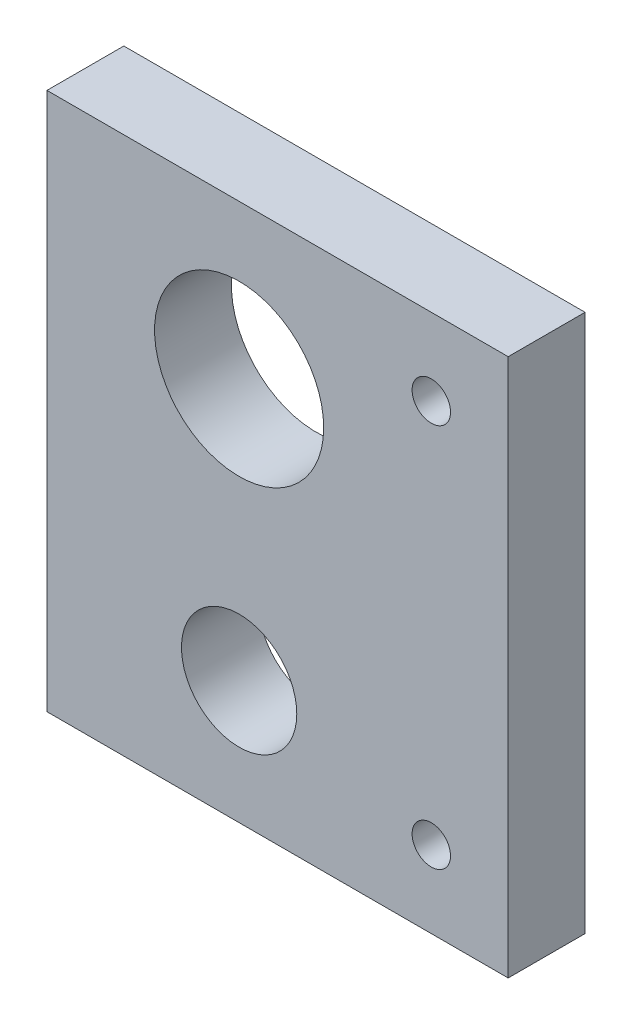
ISO-10303-21;
HEADER;
FILE_DESCRIPTION(('STEP AP214'),'2;1');
FILE_NAME('part.step','',(''),(''),'','','');
FILE_SCHEMA(('AUTOMOTIVE_DESIGN { 1 0 10303 214 1 1 1 1 }'));
ENDSEC;
DATA;
#1=APPLICATION_CONTEXT('core data for automotive mechanical design processes');
#2=APPLICATION_PROTOCOL_DEFINITION('international standard','automotive_design',2000,#1);
#3=PRODUCT_CONTEXT('',#1,'mechanical');
#4=PRODUCT('Part','Part','',(#3));
#5=PRODUCT_RELATED_PRODUCT_CATEGORY('part','',(#4));
#6=PRODUCT_DEFINITION_FORMATION('','',#4);
#7=PRODUCT_DEFINITION_CONTEXT('part definition',#1,'design');
#8=PRODUCT_DEFINITION('design','',#6,#7);
#9=PRODUCT_DEFINITION_SHAPE('','',#8);
#10=(LENGTH_UNIT() NAMED_UNIT(*) SI_UNIT(.MILLI.,.METRE.));
#11=(NAMED_UNIT(*) PLANE_ANGLE_UNIT() SI_UNIT($,.RADIAN.));
#12=(NAMED_UNIT(*) SI_UNIT($,.STERADIAN.) SOLID_ANGLE_UNIT());
#13=UNCERTAINTY_MEASURE_WITH_UNIT(LENGTH_MEASURE(1.E-05),#10,'distance_accuracy_value','');
#14=(GEOMETRIC_REPRESENTATION_CONTEXT(3) GLOBAL_UNCERTAINTY_ASSIGNED_CONTEXT((#13)) GLOBAL_UNIT_ASSIGNED_CONTEXT((#10,
#11,#12)) REPRESENTATION_CONTEXT('',''));
#15=CARTESIAN_POINT('',(0.,0.,0.));
#16=DIRECTION('',(0.,0.,1.));
#17=DIRECTION('',(1.,0.,0.));
#18=AXIS2_PLACEMENT_3D('',#15,#16,#17);
#19=CARTESIAN_POINT('',(0.,0.,10.));
#20=DIRECTION('',(0.,0.,-1.));
#21=DIRECTION('',(-1.,0.,0.));
#22=AXIS2_PLACEMENT_3D('',#19,#20,#21);
#23=PLANE('',#22);
#24=DIRECTION('',(0.,1.,0.));
#25=VECTOR('',#24,1.);
#26=CARTESIAN_POINT('',(30.,-35.,10.));
#27=LINE('',#26,#25);
#28=CARTESIAN_POINT('',(30.,-35.,10.));
#29=VERTEX_POINT('',#28);
#30=CARTESIAN_POINT('',(30.,35.,10.));
#31=VERTEX_POINT('',#30);
#32=EDGE_CURVE('E88',#29,#31,#27,.T.);
#33=ORIENTED_EDGE('',*,*,#32,.T.);
#34=DIRECTION('',(-1.,0.,0.));
#35=VECTOR('',#34,1.);
#36=CARTESIAN_POINT('',(-30.,35.,10.));
#37=LINE('',#36,#35);
#38=CARTESIAN_POINT('',(-30.,35.,10.));
#39=VERTEX_POINT('',#38);
#40=EDGE_CURVE('E83',#31,#39,#37,.T.);
#41=ORIENTED_EDGE('',*,*,#40,.T.);
#42=DIRECTION('',(0.,-1.,0.));
#43=VECTOR('',#42,1.);
#44=CARTESIAN_POINT('',(-30.,-35.,10.));
#45=LINE('',#44,#43);
#46=CARTESIAN_POINT('',(-30.,-35.,10.));
#47=VERTEX_POINT('',#46);
#48=EDGE_CURVE('E86',#39,#47,#45,.T.);
#49=ORIENTED_EDGE('',*,*,#48,.T.);
#50=DIRECTION('',(1.,0.,0.));
#51=VECTOR('',#50,1.);
#52=CARTESIAN_POINT('',(-30.,-35.,10.));
#53=LINE('',#52,#51);
#54=EDGE_CURVE('E53',#47,#29,#53,.T.);
#55=ORIENTED_EDGE('',*,*,#54,.T.);
#56=EDGE_LOOP('',(#33,#41,#49,#55));
#57=FACE_BOUND('',#56,.T.);
#58=CARTESIAN_POINT('',(-5.,15.,10.));
#59=DIRECTION('',(0.,0.,1.));
#60=DIRECTION('',(1.,0.,0.));
#61=AXIS2_PLACEMENT_3D('',#58,#59,#60);
#62=CIRCLE('',#61,11.);
#63=CARTESIAN_POINT('',(6.,15.,10.));
#64=VERTEX_POINT('',#63);
#65=EDGE_CURVE('E103',#64,#64,#62,.T.);
#66=ORIENTED_EDGE('',*,*,#65,.F.);
#67=EDGE_LOOP('',(#66));
#68=FACE_BOUND('',#67,.T.);
#69=CARTESIAN_POINT('',(-4.99999999999999,-19.,10.));
#70=DIRECTION('',(0.,0.,1.));
#71=DIRECTION('',(1.,0.,0.));
#72=AXIS2_PLACEMENT_3D('',#69,#70,#71);
#73=CIRCLE('',#72,7.5);
#74=CARTESIAN_POINT('',(2.50000000000001,-19.,10.));
#75=VERTEX_POINT('',#74);
#76=EDGE_CURVE('E118',#75,#75,#73,.T.);
#77=ORIENTED_EDGE('',*,*,#76,.F.);
#78=EDGE_LOOP('',(#77));
#79=FACE_BOUND('',#78,.T.);
#80=CARTESIAN_POINT('',(20.,25.,10.));
#81=DIRECTION('',(0.,0.,1.));
#82=DIRECTION('',(1.,0.,0.));
#83=AXIS2_PLACEMENT_3D('',#80,#81,#82);
#84=CIRCLE('',#83,2.5);
#85=CARTESIAN_POINT('',(22.5,25.,10.));
#86=VERTEX_POINT('',#85);
#87=EDGE_CURVE('E124',#86,#86,#84,.T.);
#88=ORIENTED_EDGE('',*,*,#87,.F.);
#89=EDGE_LOOP('',(#88));
#90=FACE_BOUND('',#89,.T.);
#91=CARTESIAN_POINT('',(20.,-25.,10.));
#92=DIRECTION('',(0.,0.,1.));
#93=DIRECTION('',(1.,0.,0.));
#94=AXIS2_PLACEMENT_3D('',#91,#92,#93);
#95=CIRCLE('',#94,2.5);
#96=CARTESIAN_POINT('',(22.5,-25.,10.));
#97=VERTEX_POINT('',#96);
#98=EDGE_CURVE('E130',#97,#97,#95,.T.);
#99=ORIENTED_EDGE('',*,*,#98,.F.);
#100=EDGE_LOOP('',(#99));
#101=FACE_BOUND('',#100,.T.);
#102=ADVANCED_FACE('F36',(#57,#68,#79,#90,#101),#23,.F.);
#103=CARTESIAN_POINT('',(0.,0.,0.));
#104=DIRECTION('',(0.,0.,-1.));
#105=DIRECTION('',(-1.,0.,0.));
#106=AXIS2_PLACEMENT_3D('',#103,#104,#105);
#107=PLANE('',#106);
#108=CARTESIAN_POINT('',(20.,25.,0.));
#109=DIRECTION('',(0.,0.,1.));
#110=DIRECTION('',(1.,0.,0.));
#111=AXIS2_PLACEMENT_3D('',#108,#109,#110);
#112=CIRCLE('',#111,2.5);
#113=CARTESIAN_POINT('',(22.5,25.,0.));
#114=VERTEX_POINT('',#113);
#115=EDGE_CURVE('E127',#114,#114,#112,.T.);
#116=ORIENTED_EDGE('',*,*,#115,.T.);
#117=EDGE_LOOP('',(#116));
#118=FACE_BOUND('',#117,.T.);
#119=CARTESIAN_POINT('',(-5.,15.,0.));
#120=DIRECTION('',(0.,0.,1.));
#121=DIRECTION('',(1.,0.,0.));
#122=AXIS2_PLACEMENT_3D('',#119,#120,#121);
#123=CIRCLE('',#122,11.);
#124=CARTESIAN_POINT('',(6.,15.,0.));
#125=VERTEX_POINT('',#124);
#126=EDGE_CURVE('E115',#125,#125,#123,.T.);
#127=ORIENTED_EDGE('',*,*,#126,.T.);
#128=EDGE_LOOP('',(#127));
#129=FACE_BOUND('',#128,.T.);
#130=DIRECTION('',(0.,1.,0.));
#131=VECTOR('',#130,1.);
#132=CARTESIAN_POINT('',(30.,-35.,0.));
#133=LINE('',#132,#131);
#134=CARTESIAN_POINT('',(30.,-35.,0.));
#135=VERTEX_POINT('',#134);
#136=CARTESIAN_POINT('',(30.,35.,0.));
#137=VERTEX_POINT('',#136);
#138=EDGE_CURVE('E100',#135,#137,#133,.T.);
#139=ORIENTED_EDGE('',*,*,#138,.F.);
#140=DIRECTION('',(1.,0.,0.));
#141=VECTOR('',#140,1.);
#142=CARTESIAN_POINT('',(-30.,-35.,0.));
#143=LINE('',#142,#141);
#144=CARTESIAN_POINT('',(-30.,-35.,0.));
#145=VERTEX_POINT('',#144);
#146=EDGE_CURVE('E76',#145,#135,#143,.T.);
#147=ORIENTED_EDGE('',*,*,#146,.F.);
#148=DIRECTION('',(0.,-1.,0.));
#149=VECTOR('',#148,1.);
#150=CARTESIAN_POINT('',(-30.,-35.,0.));
#151=LINE('',#150,#149);
#152=CARTESIAN_POINT('',(-30.,35.,0.));
#153=VERTEX_POINT('',#152);
#154=EDGE_CURVE('E70',#153,#145,#151,.T.);
#155=ORIENTED_EDGE('',*,*,#154,.F.);
#156=DIRECTION('',(-1.,0.,0.));
#157=VECTOR('',#156,1.);
#158=CARTESIAN_POINT('',(-30.,35.,0.));
#159=LINE('',#158,#157);
#160=EDGE_CURVE('E92',#137,#153,#159,.T.);
#161=ORIENTED_EDGE('',*,*,#160,.F.);
#162=EDGE_LOOP('',(#139,#147,#155,#161));
#163=FACE_BOUND('',#162,.T.);
#164=CARTESIAN_POINT('',(-4.99999999999999,-19.,0.));
#165=DIRECTION('',(0.,0.,1.));
#166=DIRECTION('',(1.,0.,0.));
#167=AXIS2_PLACEMENT_3D('',#164,#165,#166);
#168=CIRCLE('',#167,7.5);
#169=CARTESIAN_POINT('',(2.50000000000001,-19.,0.));
#170=VERTEX_POINT('',#169);
#171=EDGE_CURVE('E121',#170,#170,#168,.T.);
#172=ORIENTED_EDGE('',*,*,#171,.T.);
#173=EDGE_LOOP('',(#172));
#174=FACE_BOUND('',#173,.T.);
#175=CARTESIAN_POINT('',(20.,-25.,0.));
#176=DIRECTION('',(0.,0.,1.));
#177=DIRECTION('',(1.,0.,0.));
#178=AXIS2_PLACEMENT_3D('',#175,#176,#177);
#179=CIRCLE('',#178,2.5);
#180=CARTESIAN_POINT('',(22.5,-25.,0.));
#181=VERTEX_POINT('',#180);
#182=EDGE_CURVE('E133',#181,#181,#179,.T.);
#183=ORIENTED_EDGE('',*,*,#182,.T.);
#184=EDGE_LOOP('',(#183));
#185=FACE_BOUND('',#184,.T.);
#186=ADVANCED_FACE('F111',(#118,#129,#163,#174,#185),#107,.T.);
#187=CARTESIAN_POINT('',(30.,-35.,10.));
#188=DIRECTION('',(-1.,0.,0.));
#189=DIRECTION('',(0.,0.,1.));
#190=AXIS2_PLACEMENT_3D('',#187,#188,#189);
#191=PLANE('',#190);
#192=ORIENTED_EDGE('',*,*,#138,.T.);
#193=DIRECTION('',(0.,0.,-1.));
#194=VECTOR('',#193,1.);
#195=CARTESIAN_POINT('',(30.,35.,10.));
#196=LINE('',#195,#194);
#197=EDGE_CURVE('E11',#31,#137,#196,.T.);
#198=ORIENTED_EDGE('',*,*,#197,.F.);
#199=ORIENTED_EDGE('',*,*,#32,.F.);
#200=DIRECTION('',(0.,0.,-1.));
#201=VECTOR('',#200,1.);
#202=CARTESIAN_POINT('',(30.,-35.,10.));
#203=LINE('',#202,#201);
#204=EDGE_CURVE('E96',#29,#135,#203,.T.);
#205=ORIENTED_EDGE('',*,*,#204,.T.);
#206=EDGE_LOOP('',(#192,#198,#199,#205));
#207=FACE_BOUND('',#206,.T.);
#208=ADVANCED_FACE('F38',(#207),#191,.F.);
#209=CARTESIAN_POINT('',(-30.,35.,10.));
#210=DIRECTION('',(0.,-1.,0.));
#211=DIRECTION('',(0.,0.,-1.));
#212=AXIS2_PLACEMENT_3D('',#209,#210,#211);
#213=PLANE('',#212);
#214=ORIENTED_EDGE('',*,*,#160,.T.);
#215=DIRECTION('',(0.,0.,-1.));
#216=VECTOR('',#215,1.);
#217=CARTESIAN_POINT('',(-30.,35.,10.));
#218=LINE('',#217,#216);
#219=EDGE_CURVE('E45',#39,#153,#218,.T.);
#220=ORIENTED_EDGE('',*,*,#219,.F.);
#221=ORIENTED_EDGE('',*,*,#40,.F.);
#222=ORIENTED_EDGE('',*,*,#197,.T.);
#223=EDGE_LOOP('',(#214,#220,#221,#222));
#224=FACE_BOUND('',#223,.T.);
#225=ADVANCED_FACE('F91',(#224),#213,.F.);
#226=CARTESIAN_POINT('',(-30.,-35.,10.));
#227=DIRECTION('',(1.,0.,0.));
#228=DIRECTION('',(0.,0.,-1.));
#229=AXIS2_PLACEMENT_3D('',#226,#227,#228);
#230=PLANE('',#229);
#231=ORIENTED_EDGE('',*,*,#154,.T.);
#232=DIRECTION('',(0.,0.,-1.));
#233=VECTOR('',#232,1.);
#234=CARTESIAN_POINT('',(-30.,-35.,10.));
#235=LINE('',#234,#233);
#236=EDGE_CURVE('E93',#47,#145,#235,.T.);
#237=ORIENTED_EDGE('',*,*,#236,.F.);
#238=ORIENTED_EDGE('',*,*,#48,.F.);
#239=ORIENTED_EDGE('',*,*,#219,.T.);
#240=EDGE_LOOP('',(#231,#237,#238,#239));
#241=FACE_BOUND('',#240,.T.);
#242=ADVANCED_FACE('F94',(#241),#230,.F.);
#243=CARTESIAN_POINT('',(-30.,-35.,10.));
#244=DIRECTION('',(0.,1.,0.));
#245=DIRECTION('',(0.,0.,1.));
#246=AXIS2_PLACEMENT_3D('',#243,#244,#245);
#247=PLANE('',#246);
#248=ORIENTED_EDGE('',*,*,#146,.T.);
#249=ORIENTED_EDGE('',*,*,#204,.F.);
#250=ORIENTED_EDGE('',*,*,#54,.F.);
#251=ORIENTED_EDGE('',*,*,#236,.T.);
#252=EDGE_LOOP('',(#248,#249,#250,#251));
#253=FACE_BOUND('',#252,.T.);
#254=ADVANCED_FACE('F108',(#253),#247,.F.);
#255=CARTESIAN_POINT('',(-5.,15.,10.));
#256=DIRECTION('',(0.,0.,-1.));
#257=DIRECTION('',(-1.,0.,0.));
#258=AXIS2_PLACEMENT_3D('',#255,#256,#257);
#259=CYLINDRICAL_SURFACE('',#258,11.);
#260=ORIENTED_EDGE('',*,*,#65,.T.);
#261=EDGE_LOOP('',(#260));
#262=FACE_BOUND('',#261,.T.);
#263=ORIENTED_EDGE('',*,*,#126,.F.);
#264=EDGE_LOOP('',(#263));
#265=FACE_BOUND('',#264,.T.);
#266=ADVANCED_FACE('F150',(#262,#265),#259,.F.);
#267=CARTESIAN_POINT('',(-4.99999999999999,-19.,10.));
#268=DIRECTION('',(0.,0.,-1.));
#269=DIRECTION('',(-1.,0.,0.));
#270=AXIS2_PLACEMENT_3D('',#267,#268,#269);
#271=CYLINDRICAL_SURFACE('',#270,7.5);
#272=ORIENTED_EDGE('',*,*,#76,.T.);
#273=EDGE_LOOP('',(#272));
#274=FACE_BOUND('',#273,.T.);
#275=ORIENTED_EDGE('',*,*,#171,.F.);
#276=EDGE_LOOP('',(#275));
#277=FACE_BOUND('',#276,.T.);
#278=ADVANCED_FACE('F196',(#274,#277),#271,.F.);
#279=CARTESIAN_POINT('',(20.,25.,10.));
#280=DIRECTION('',(0.,0.,-1.));
#281=DIRECTION('',(-1.,0.,0.));
#282=AXIS2_PLACEMENT_3D('',#279,#280,#281);
#283=CYLINDRICAL_SURFACE('',#282,2.5);
#284=ORIENTED_EDGE('',*,*,#87,.T.);
#285=EDGE_LOOP('',(#284));
#286=FACE_BOUND('',#285,.T.);
#287=ORIENTED_EDGE('',*,*,#115,.F.);
#288=EDGE_LOOP('',(#287));
#289=FACE_BOUND('',#288,.T.);
#290=ADVANCED_FACE('F204',(#286,#289),#283,.F.);
#291=CARTESIAN_POINT('',(20.,-25.,10.));
#292=DIRECTION('',(0.,0.,-1.));
#293=DIRECTION('',(-1.,0.,0.));
#294=AXIS2_PLACEMENT_3D('',#291,#292,#293);
#295=CYLINDRICAL_SURFACE('',#294,2.5);
#296=ORIENTED_EDGE('',*,*,#98,.T.);
#297=EDGE_LOOP('',(#296));
#298=FACE_BOUND('',#297,.T.);
#299=ORIENTED_EDGE('',*,*,#182,.F.);
#300=EDGE_LOOP('',(#299));
#301=FACE_BOUND('',#300,.T.);
#302=ADVANCED_FACE('F139',(#298,#301),#295,.F.);
#303=CLOSED_SHELL('',(#102,#186,#208,#225,#242,#254,#266,#278,#290,#302));
#304=MANIFOLD_SOLID_BREP('B2',#303);
#305=ADVANCED_BREP_SHAPE_REPRESENTATION('',(#18,#304),#14);
#306=SHAPE_DEFINITION_REPRESENTATION(#9,#305);
ENDSEC;
END-ISO-10303-21;
